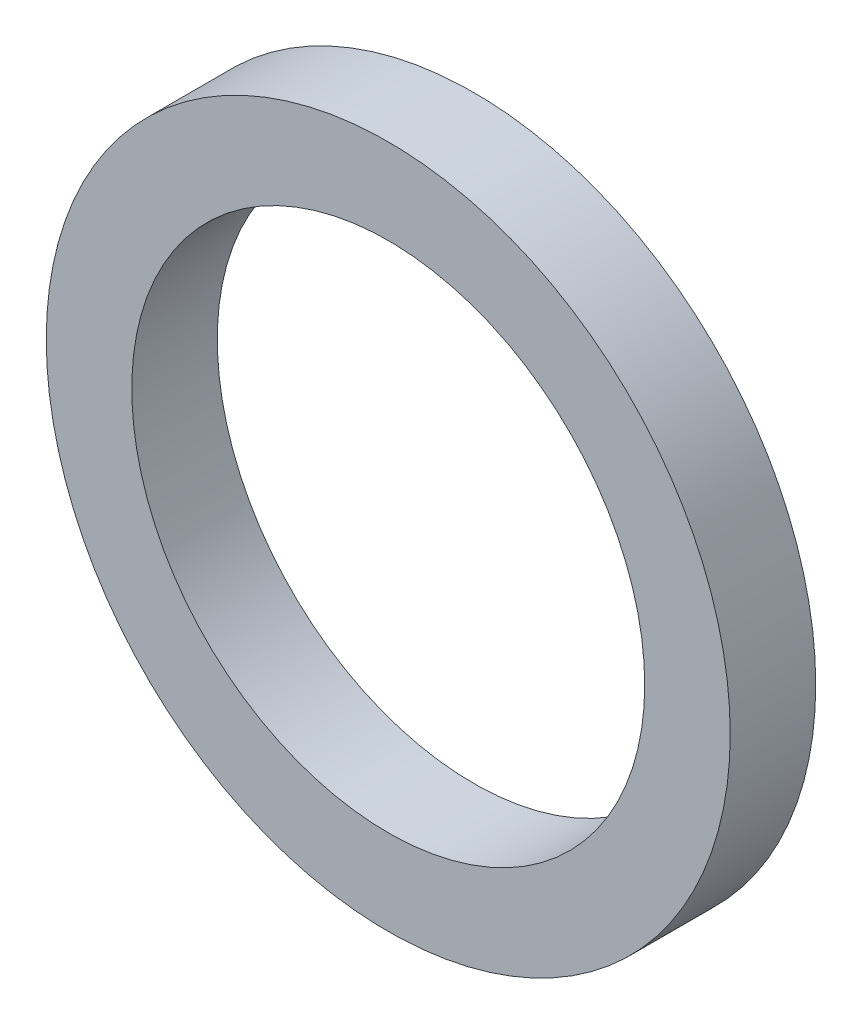
ISO-10303-21;
HEADER;
FILE_DESCRIPTION(('STEP AP214'),'2;1');
FILE_NAME('part.step','',(''),(''),'','','');
FILE_SCHEMA(('AUTOMOTIVE_DESIGN { 1 0 10303 214 1 1 1 1 }'));
ENDSEC;
DATA;
#1=APPLICATION_CONTEXT('core data for automotive mechanical design processes');
#2=APPLICATION_PROTOCOL_DEFINITION('international standard','automotive_design',2000,#1);
#3=PRODUCT_CONTEXT('',#1,'mechanical');
#4=PRODUCT('Part','Part','',(#3));
#5=PRODUCT_RELATED_PRODUCT_CATEGORY('part','',(#4));
#6=PRODUCT_DEFINITION_FORMATION('','',#4);
#7=PRODUCT_DEFINITION_CONTEXT('part definition',#1,'design');
#8=PRODUCT_DEFINITION('design','',#6,#7);
#9=PRODUCT_DEFINITION_SHAPE('','',#8);
#10=(LENGTH_UNIT() NAMED_UNIT(*) SI_UNIT(.MILLI.,.METRE.));
#11=(NAMED_UNIT(*) PLANE_ANGLE_UNIT() SI_UNIT($,.RADIAN.));
#12=(NAMED_UNIT(*) SI_UNIT($,.STERADIAN.) SOLID_ANGLE_UNIT());
#13=UNCERTAINTY_MEASURE_WITH_UNIT(LENGTH_MEASURE(1.E-05),#10,'distance_accuracy_value','');
#14=(GEOMETRIC_REPRESENTATION_CONTEXT(3) GLOBAL_UNCERTAINTY_ASSIGNED_CONTEXT((#13)) GLOBAL_UNIT_ASSIGNED_CONTEXT((#10,
#11,#12)) REPRESENTATION_CONTEXT('',''));
#15=CARTESIAN_POINT('',(0.,0.,0.));
#16=DIRECTION('',(0.,0.,1.));
#17=DIRECTION('',(1.,0.,0.));
#18=AXIS2_PLACEMENT_3D('',#15,#16,#17);
#19=CARTESIAN_POINT('',(0.,0.,1.));
#20=DIRECTION('',(0.,0.,1.));
#21=DIRECTION('',(1.,0.,0.));
#22=AXIS2_PLACEMENT_3D('',#19,#20,#21);
#23=PLANE('',#22);
#24=CARTESIAN_POINT('',(0.,0.,1.));
#25=DIRECTION('',(0.,0.,1.));
#26=DIRECTION('',(1.,0.,0.));
#27=AXIS2_PLACEMENT_3D('',#24,#25,#26);
#28=CIRCLE('',#27,4.);
#29=CARTESIAN_POINT('',(4.,0.,1.));
#30=VERTEX_POINT('',#29);
#31=EDGE_CURVE('E10',#30,#30,#28,.T.);
#32=ORIENTED_EDGE('',*,*,#31,.T.);
#33=EDGE_LOOP('',(#32));
#34=FACE_BOUND('',#33,.T.);
#35=CARTESIAN_POINT('',(0.,0.,1.));
#36=DIRECTION('',(0.,0.,1.));
#37=DIRECTION('',(1.,0.,0.));
#38=AXIS2_PLACEMENT_3D('',#35,#36,#37);
#39=CIRCLE('',#38,3.);
#40=CARTESIAN_POINT('',(3.,0.,1.));
#41=VERTEX_POINT('',#40);
#42=EDGE_CURVE('E42',#41,#41,#39,.T.);
#43=ORIENTED_EDGE('',*,*,#42,.F.);
#44=EDGE_LOOP('',(#43));
#45=FACE_BOUND('',#44,.T.);
#46=ADVANCED_FACE('F31',(#34,#45),#23,.T.);
#47=CARTESIAN_POINT('',(0.,0.,0.));
#48=DIRECTION('',(0.,0.,1.));
#49=DIRECTION('',(1.,0.,0.));
#50=AXIS2_PLACEMENT_3D('',#47,#48,#49);
#51=PLANE('',#50);
#52=CARTESIAN_POINT('',(0.,0.,0.));
#53=DIRECTION('',(0.,0.,1.));
#54=DIRECTION('',(1.,0.,0.));
#55=AXIS2_PLACEMENT_3D('',#52,#53,#54);
#56=CIRCLE('',#55,4.);
#57=CARTESIAN_POINT('',(4.,0.,0.));
#58=VERTEX_POINT('',#57);
#59=EDGE_CURVE('E35',#58,#58,#56,.T.);
#60=ORIENTED_EDGE('',*,*,#59,.F.);
#61=EDGE_LOOP('',(#60));
#62=FACE_BOUND('',#61,.T.);
#63=CARTESIAN_POINT('',(0.,0.,0.));
#64=DIRECTION('',(0.,0.,1.));
#65=DIRECTION('',(1.,0.,0.));
#66=AXIS2_PLACEMENT_3D('',#63,#64,#65);
#67=CIRCLE('',#66,3.);
#68=CARTESIAN_POINT('',(3.,0.,0.));
#69=VERTEX_POINT('',#68);
#70=EDGE_CURVE('E44',#69,#69,#67,.T.);
#71=ORIENTED_EDGE('',*,*,#70,.T.);
#72=EDGE_LOOP('',(#71));
#73=FACE_BOUND('',#72,.T.);
#74=ADVANCED_FACE('F54',(#62,#73),#51,.F.);
#75=CARTESIAN_POINT('',(0.,0.,1.));
#76=DIRECTION('',(0.,0.,-1.));
#77=DIRECTION('',(-1.,0.,0.));
#78=AXIS2_PLACEMENT_3D('',#75,#76,#77);
#79=CYLINDRICAL_SURFACE('',#78,4.);
#80=ORIENTED_EDGE('',*,*,#31,.F.);
#81=EDGE_LOOP('',(#80));
#82=FACE_BOUND('',#81,.T.);
#83=ORIENTED_EDGE('',*,*,#59,.T.);
#84=EDGE_LOOP('',(#83));
#85=FACE_BOUND('',#84,.T.);
#86=ADVANCED_FACE('F33',(#82,#85),#79,.T.);
#87=CARTESIAN_POINT('',(0.,0.,1.));
#88=DIRECTION('',(0.,0.,-1.));
#89=DIRECTION('',(-1.,0.,0.));
#90=AXIS2_PLACEMENT_3D('',#87,#88,#89);
#91=CYLINDRICAL_SURFACE('',#90,3.);
#92=ORIENTED_EDGE('',*,*,#42,.T.);
#93=EDGE_LOOP('',(#92));
#94=FACE_BOUND('',#93,.T.);
#95=ORIENTED_EDGE('',*,*,#70,.F.);
#96=EDGE_LOOP('',(#95));
#97=FACE_BOUND('',#96,.T.);
#98=ADVANCED_FACE('F50',(#94,#97),#91,.F.);
#99=CLOSED_SHELL('',(#46,#74,#86,#98));
#100=MANIFOLD_SOLID_BREP('B2',#99);
#101=ADVANCED_BREP_SHAPE_REPRESENTATION('',(#18,#100),#14);
#102=SHAPE_DEFINITION_REPRESENTATION(#9,#101);
ENDSEC;
END-ISO-10303-21;
